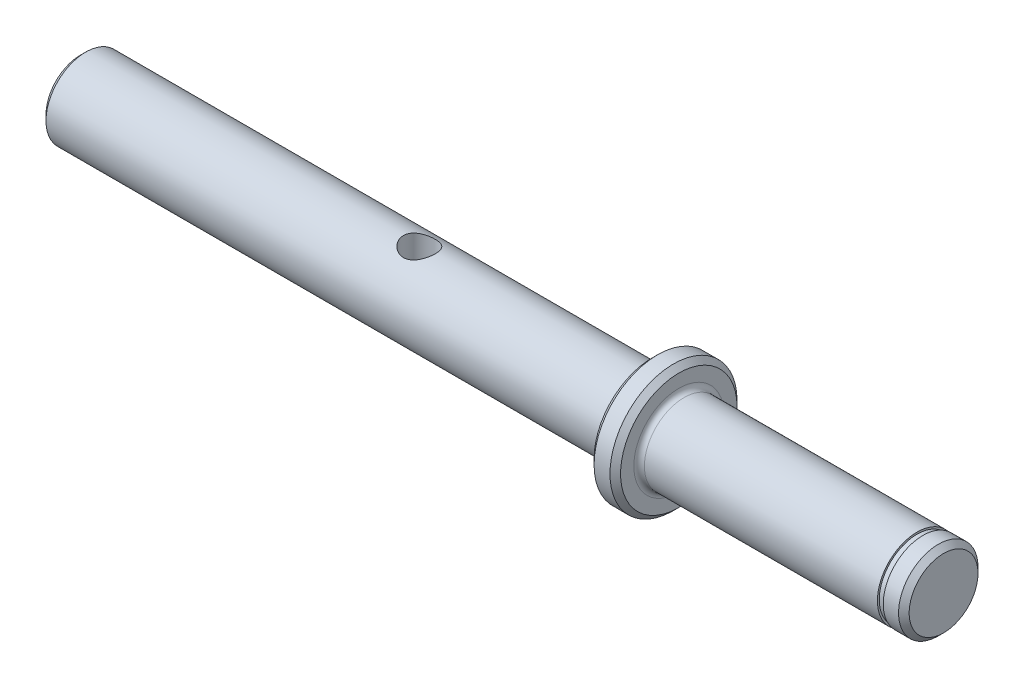
ISO-10303-21;
HEADER;
FILE_DESCRIPTION(('STEP AP214'),'2;1');
FILE_NAME('part.step','',(''),(''),'','','');
FILE_SCHEMA(('AUTOMOTIVE_DESIGN { 1 0 10303 214 1 1 1 1 }'));
ENDSEC;
DATA;
#1=APPLICATION_CONTEXT('core data for automotive mechanical design processes');
#2=APPLICATION_PROTOCOL_DEFINITION('international standard','automotive_design',2000,#1);
#3=PRODUCT_CONTEXT('',#1,'mechanical');
#4=PRODUCT('Part','Part','',(#3));
#5=PRODUCT_RELATED_PRODUCT_CATEGORY('part','',(#4));
#6=PRODUCT_DEFINITION_FORMATION('','',#4);
#7=PRODUCT_DEFINITION_CONTEXT('part definition',#1,'design');
#8=PRODUCT_DEFINITION('design','',#6,#7);
#9=PRODUCT_DEFINITION_SHAPE('','',#8);
#10=(LENGTH_UNIT() NAMED_UNIT(*) SI_UNIT(.MILLI.,.METRE.));
#11=(NAMED_UNIT(*) PLANE_ANGLE_UNIT() SI_UNIT($,.RADIAN.));
#12=(NAMED_UNIT(*) SI_UNIT($,.STERADIAN.) SOLID_ANGLE_UNIT());
#13=UNCERTAINTY_MEASURE_WITH_UNIT(LENGTH_MEASURE(1.E-05),#10,'distance_accuracy_value','');
#14=(GEOMETRIC_REPRESENTATION_CONTEXT(3) GLOBAL_UNCERTAINTY_ASSIGNED_CONTEXT((#13)) GLOBAL_UNIT_ASSIGNED_CONTEXT((#10,
#11,#12)) REPRESENTATION_CONTEXT('',''));
#15=CARTESIAN_POINT('',(0.,0.,0.));
#16=DIRECTION('',(0.,0.,1.));
#17=DIRECTION('',(1.,0.,0.));
#18=AXIS2_PLACEMENT_3D('',#15,#16,#17);
#19=CARTESIAN_POINT('',(0.,0.,0.));
#20=DIRECTION('',(1.,0.,0.));
#21=DIRECTION('',(0.,0.,-1.));
#22=AXIS2_PLACEMENT_3D('',#19,#20,#21);
#23=CYLINDRICAL_SURFACE('',#22,7.5);
#24=CARTESIAN_POINT('',(106.,0.,0.));
#25=DIRECTION('',(-1.,0.,0.));
#26=DIRECTION('',(0.,0.,1.));
#27=AXIS2_PLACEMENT_3D('',#24,#25,#26);
#28=CIRCLE('',#27,7.5);
#29=CARTESIAN_POINT('',(106.,0.,7.5));
#30=VERTEX_POINT('',#29);
#31=EDGE_CURVE('E52',#30,#30,#28,.T.);
#32=ORIENTED_EDGE('',*,*,#31,.T.);
#33=EDGE_LOOP('',(#32));
#34=FACE_BOUND('',#33,.T.);
#35=CARTESIAN_POINT('',(0.999999999999997,0.,0.));
#36=DIRECTION('',(-1.,0.,0.));
#37=DIRECTION('',(0.,0.,1.));
#38=AXIS2_PLACEMENT_3D('',#35,#36,#37);
#39=CIRCLE('',#38,7.5);
#40=CARTESIAN_POINT('',(0.999999999999997,0.,7.5));
#41=VERTEX_POINT('',#40);
#42=EDGE_CURVE('E67',#41,#41,#39,.F.);
#43=ORIENTED_EDGE('',*,*,#42,.T.);
#44=EDGE_LOOP('',(#43));
#45=FACE_BOUND('',#44,.T.);
#46=CARTESIAN_POINT('',(64.,-6.87386354243376,-3.00000000000001));
#47=CARTESIAN_POINT('',(63.8393144654306,-6.87387034169605,-2.99999310102034));
#48=CARTESIAN_POINT('',(63.6783605585022,-6.87957650695683,-2.98701260330111));
#49=CARTESIAN_POINT('',(63.3610913738506,-6.901666249599,-2.93560066312236));
#50=CARTESIAN_POINT('',(63.2047890184922,-6.9180771094252,-2.89710418548512));
#51=CARTESIAN_POINT('',(62.9019222865438,-6.95940616078833,-2.79635331714324));
#52=CARTESIAN_POINT('',(62.7553236350632,-6.98429226391323,-2.73418843497827));
#53=CARTESIAN_POINT('',(62.4746719677065,-7.0397201578331,-2.58813019791229));
#54=CARTESIAN_POINT('',(62.3406162212138,-7.07026071330917,-2.5042415873656));
#55=CARTESIAN_POINT('',(62.0811095281835,-7.13551292343503,-2.31198302134881));
#56=CARTESIAN_POINT('',(61.9564654009041,-7.17035875533909,-2.20256905254826));
#57=CARTESIAN_POINT('',(61.7267064687163,-7.23918686872916,-1.96456364269823));
#58=CARTESIAN_POINT('',(61.6215984884354,-7.27316884487642,-1.8359655281602));
#59=CARTESIAN_POINT('',(61.4298904145354,-7.33805111462092,-1.55700947005954));
#60=CARTESIAN_POINT('',(61.3441835504711,-7.36877705418855,-1.40599344962864));
#61=CARTESIAN_POINT('',(61.1997346447393,-7.42205891553774,-1.09023798310295));
#62=CARTESIAN_POINT('',(61.1409816306267,-7.44461816104874,-0.925504153615321));
#63=CARTESIAN_POINT('',(61.0549877710104,-7.47807487485913,-0.595449640559626));
#64=CARTESIAN_POINT('',(61.0263590290447,-7.48948405155942,-0.43054347728747));
#65=CARTESIAN_POINT('',(60.9969572713278,-7.50120466031146,-0.0978994928759376));
#66=CARTESIAN_POINT('',(60.9961738660513,-7.50152023155835,0.0698372487591226));
#67=CARTESIAN_POINT('',(61.0217241547063,-7.49132944230919,0.39334874205314));
#68=CARTESIAN_POINT('',(61.0465371591321,-7.48142995157228,0.549266179305693));
#69=CARTESIAN_POINT('',(61.1199893144545,-7.45273937203712,0.854509663832879));
#70=CARTESIAN_POINT('',(61.1686302135977,-7.43394763082012,1.00383522658687));
#71=CARTESIAN_POINT('',(61.2889547243174,-7.388952366862,1.29434690776585));
#72=CARTESIAN_POINT('',(61.3609745722231,-7.36264140699335,1.43537643506835));
#73=CARTESIAN_POINT('',(61.5256975103787,-7.30521877770412,1.70371222611198));
#74=CARTESIAN_POINT('',(61.6184076896502,-7.27410546400724,1.83101376407695));
#75=CARTESIAN_POINT('',(61.8289737039158,-7.20782455764184,2.07715324198527));
#76=CARTESIAN_POINT('',(61.9480808388592,-7.17252489767638,2.19488676789949));
#77=CARTESIAN_POINT('',(62.204485857748,-7.10342491459894,2.40916112308898));
#78=CARTESIAN_POINT('',(62.3417896722934,-7.06962508512114,2.50569501568048));
#79=CARTESIAN_POINT('',(62.6356285335609,-7.00645346113534,2.67735628307892));
#80=CARTESIAN_POINT('',(62.792597245508,-6.97723371086561,2.7518019774544));
#81=CARTESIAN_POINT('',(63.1183232354683,-6.92831385516126,2.8727643897997));
#82=CARTESIAN_POINT('',(63.2870727770899,-6.90860756836966,2.91929924756698));
#83=CARTESIAN_POINT('',(63.6205536662012,-6.88244639554074,2.98043242328235));
#84=CARTESIAN_POINT('',(63.7849006706928,-6.87525549684207,2.99680814522182));
#85=CARTESIAN_POINT('',(64.1141158116393,-6.87284246803558,3.00234198966434));
#86=CARTESIAN_POINT('',(64.2789837749135,-6.87761670840543,2.99150836588693));
#87=CARTESIAN_POINT('',(64.5946884024354,-6.8978406653867,2.94454934218505));
#88=CARTESIAN_POINT('',(64.7457894061001,-6.91266686697452,2.9098995930358));
#89=CARTESIAN_POINT('',(65.0399326071782,-6.9505507654101,2.81820628036631));
#90=CARTESIAN_POINT('',(65.1829730096607,-6.97361028732897,2.76115775145342));
#91=CARTESIAN_POINT('',(65.4634035366935,-7.02650672790152,2.62370345922236));
#92=CARTESIAN_POINT('',(65.6003292830418,-7.05658056958766,2.54244430239697));
#93=CARTESIAN_POINT('',(65.8592244811624,-7.11975577736693,2.35974783666273));
#94=CARTESIAN_POINT('',(65.9811878091932,-7.15285837344067,2.25830231022284));
#95=CARTESIAN_POINT('',(66.2160601128991,-7.22131373957125,2.02926631752086));
#96=CARTESIAN_POINT('',(66.3276348479374,-7.2566521092785,1.90029814416815));
#97=CARTESIAN_POINT('',(66.5277656149147,-7.32329691851298,1.62462545005275));
#98=CARTESIAN_POINT('',(66.6163207098927,-7.35460319389703,1.47792020769991));
#99=CARTESIAN_POINT('',(66.767571439695,-7.40975573850585,1.17041990100452));
#100=CARTESIAN_POINT('',(66.8302732662605,-7.4336037936099,1.00962822149812));
#101=CARTESIAN_POINT('',(66.9273232785996,-7.47109070203356,0.678590386371822));
#102=CARTESIAN_POINT('',(66.961686852116,-7.48473509559155,0.508349415415228));
#103=CARTESIAN_POINT('',(66.9992570524793,-7.49968512317788,0.17522476554392));
#104=CARTESIAN_POINT('',(67.004350192843,-7.50173770124618,0.0125857389781277));
#105=CARTESIAN_POINT('',(66.9882167809248,-7.49529063560582,-0.311150753688403));
#106=CARTESIAN_POINT('',(66.9669942127666,-7.48679258923162,-0.472248449421586));
#107=CARTESIAN_POINT('',(66.9001798180002,-7.46057270072754,-0.783256352600104));
#108=CARTESIAN_POINT('',(66.8553565828652,-7.44314221048496,-0.933358205797312));
#109=CARTESIAN_POINT('',(66.7434207911784,-7.40092421651037,-1.22388353331391));
#110=CARTESIAN_POINT('',(66.6763041235914,-7.37613535594289,-1.36430521678369));
#111=CARTESIAN_POINT('',(66.5183452099702,-7.320271419178,-1.63830455820774));
#112=CARTESIAN_POINT('',(66.4265855870123,-7.288966960308,-1.77130556278109));
#113=CARTESIAN_POINT('',(66.2233171918795,-7.22384103340619,-2.02058106022191));
#114=CARTESIAN_POINT('',(66.1118002455877,-7.19001852696379,-2.13684859379604));
#115=CARTESIAN_POINT('',(65.864027279727,-7.1210665105152,-2.35680182841674));
#116=CARTESIAN_POINT('',(65.7266671372839,-7.08598570842144,-2.45926306504163));
#117=CARTESIAN_POINT('',(65.4355863464188,-7.02074485276124,-2.63977144144724));
#118=CARTESIAN_POINT('',(65.2818637773197,-6.99058537793172,-2.71781571083652));
#119=CARTESIAN_POINT('',(64.9764457202947,-6.94138371358595,-2.84098572677452));
#120=CARTESIAN_POINT('',(64.8258075959314,-6.92158645020622,-2.88843803497902));
#121=CARTESIAN_POINT('',(64.518266437761,-6.89168739051179,-2.95907986392735));
#122=CARTESIAN_POINT('',(64.3613821398635,-6.88155858435652,-2.98233699287412));
#123=CARTESIAN_POINT('',(64.1698326413327,-6.87587645913135,-2.9953830327827));
#124=CARTESIAN_POINT('',(64.1358977794654,-6.87512296675926,-2.99711296127843));
#125=CARTESIAN_POINT('',(64.0679792848042,-6.87411577084084,-2.99942221686376));
#126=CARTESIAN_POINT('',(64.0339956486173,-6.8738621039388,-3.00000145959181));
#127=CARTESIAN_POINT('',(64.,-6.87386354243376,-3.00000000000001));
#128=B_SPLINE_CURVE_WITH_KNOTS('',3,(#46,#47,#48,#49,#50,#51,#52,#53,#54,#55,#56,#57,#58,#59,
#60,#61,#62,#63,#64,#65,#66,#67,#68,#69,#70,#71,#72,#73,#74,#75,#76,#77,#78,#79,#80,#81,#82,#83,
#84,#85,#86,#87,#88,#89,#90,#91,#92,#93,#94,#95,#96,#97,#98,#99,#100,#101,#102,#103,#104,#105,
#106,#107,#108,#109,#110,#111,#112,#113,#114,#115,#116,#117,#118,#119,#120,#121,#122,#123,#124,
#125,#126,#127),.UNSPECIFIED.,.T.,.F.,(4,2,2,2,2,2,2,2,2,2,2,2,2,2,2,2,2,2,2,2,2,2,2,2,2,2,2,2,
2,2,2,2,2,2,2,2,2,2,2,2,4),(0.,0.481916473151485,0.965066003733377,1.44640623494009,
1.92764143235794,2.43383427426639,2.94020361522515,3.46654003637144,3.99266200454222,
4.49331274330777,4.9937766795851,5.46612967245455,5.93851732693591,6.41802450352349,
6.89769622410049,7.40886066122036,7.92019210690693,8.44596688075889,8.97139957200156,
9.46473221286632,9.95791522361912,10.4230087212772,10.8882053797746,11.3722673197906,
11.8565267178878,12.3765560137047,12.8966064727912,13.4165323096922,13.9361756393121,
14.4219155963393,14.9075820226891,15.3783299166503,15.8491646674288,16.3408057670989,
16.8326507484631,17.3549437992842,17.8772982263879,18.3527499122862,18.8268694532887,
18.928819278144,19.0307765770884),.UNSPECIFIED.);
#129=CARTESIAN_POINT('',(64.,-6.87386354243376,-3.00000000000001));
#130=VERTEX_POINT('',#129);
#131=EDGE_CURVE('E106',#130,#130,#128,.T.);
#132=ORIENTED_EDGE('',*,*,#131,.T.);
#133=EDGE_LOOP('',(#132));
#134=FACE_BOUND('',#133,.T.);
#135=CARTESIAN_POINT('',(64.,6.87386354243376,-3.00000000000001));
#136=CARTESIAN_POINT('',(64.1606855345694,6.87387034169604,-2.99999310102034));
#137=CARTESIAN_POINT('',(64.3216394414978,6.87957650695683,-2.98701260330111));
#138=CARTESIAN_POINT('',(64.6389086261494,6.901666249599,-2.93560066312236));
#139=CARTESIAN_POINT('',(64.7952109815078,6.9180771094252,-2.89710418548511));
#140=CARTESIAN_POINT('',(65.0980777134562,6.95940616078833,-2.79635331714324));
#141=CARTESIAN_POINT('',(65.2446763649369,6.98429226391323,-2.73418843497827));
#142=CARTESIAN_POINT('',(65.5253280322935,7.0397201578331,-2.58813019791229));
#143=CARTESIAN_POINT('',(65.6593837787862,7.07026071330917,-2.5042415873656));
#144=CARTESIAN_POINT('',(65.9188904718165,7.13551292343503,-2.31198302134881));
#145=CARTESIAN_POINT('',(66.0435345990959,7.17035875533909,-2.20256905254827));
#146=CARTESIAN_POINT('',(66.2732935312837,7.23918686872916,-1.96456364269823));
#147=CARTESIAN_POINT('',(66.3784015115646,7.27316884487642,-1.83596552816021));
#148=CARTESIAN_POINT('',(66.5701095854646,7.33805111462092,-1.55700947005955));
#149=CARTESIAN_POINT('',(66.6558164495289,7.36877705418855,-1.40599344962864));
#150=CARTESIAN_POINT('',(66.8002653552607,7.42205891553774,-1.09023798310295));
#151=CARTESIAN_POINT('',(66.8590183693733,7.44461816104874,-0.92550415361532));
#152=CARTESIAN_POINT('',(66.9450122289896,7.47807487485913,-0.595449640559623));
#153=CARTESIAN_POINT('',(66.9736409709553,7.48948405155942,-0.430543477287467));
#154=CARTESIAN_POINT('',(67.0030427286722,7.50120466031146,-0.097899492875934));
#155=CARTESIAN_POINT('',(67.0038261339487,7.50152023155834,0.0698372487591263));
#156=CARTESIAN_POINT('',(66.9782758452937,7.49132944230918,0.393348742053143));
#157=CARTESIAN_POINT('',(66.9534628408679,7.48142995157228,0.549266179305695));
#158=CARTESIAN_POINT('',(66.8800106855456,7.45273937203712,0.85450966383288));
#159=CARTESIAN_POINT('',(66.8313697864023,7.43394763082012,1.00383522658687));
#160=CARTESIAN_POINT('',(66.7110452756826,7.388952366862,1.29434690776585));
#161=CARTESIAN_POINT('',(66.6390254277769,7.36264140699335,1.43537643506835));
#162=CARTESIAN_POINT('',(66.4743024896213,7.30521877770412,1.70371222611198));
#163=CARTESIAN_POINT('',(66.3815923103498,7.27410546400724,1.83101376407695));
#164=CARTESIAN_POINT('',(66.1710262960842,7.20782455764184,2.07715324198527));
#165=CARTESIAN_POINT('',(66.0519191611408,7.17252489767638,2.19488676789949));
#166=CARTESIAN_POINT('',(65.795514142252,7.10342491459894,2.40916112308899));
#167=CARTESIAN_POINT('',(65.6582103277066,7.06962508512114,2.50569501568049));
#168=CARTESIAN_POINT('',(65.3643714664391,7.00645346113534,2.67735628307892));
#169=CARTESIAN_POINT('',(65.207402754492,6.97723371086561,2.7518019774544));
#170=CARTESIAN_POINT('',(64.8816767645317,6.92831385516126,2.8727643897997));
#171=CARTESIAN_POINT('',(64.7129272229101,6.90860756836966,2.91929924756698));
#172=CARTESIAN_POINT('',(64.3794463337988,6.88244639554074,2.98043242328235));
#173=CARTESIAN_POINT('',(64.2150993293072,6.87525549684207,2.99680814522182));
#174=CARTESIAN_POINT('',(63.8858841883606,6.87284246803558,3.00234198966434));
#175=CARTESIAN_POINT('',(63.7210162250865,6.87761670840543,2.99150836588693));
#176=CARTESIAN_POINT('',(63.4053115975646,6.8978406653867,2.94454934218505));
#177=CARTESIAN_POINT('',(63.2542105938999,6.91266686697452,2.90989959303579));
#178=CARTESIAN_POINT('',(62.9600673928218,6.9505507654101,2.81820628036631));
#179=CARTESIAN_POINT('',(62.8170269903393,6.97361028732897,2.76115775145342));
#180=CARTESIAN_POINT('',(62.5365964633065,7.02650672790152,2.62370345922236));
#181=CARTESIAN_POINT('',(62.3996707169582,7.05658056958766,2.54244430239697));
#182=CARTESIAN_POINT('',(62.1407755188376,7.11975577736693,2.35974783666273));
#183=CARTESIAN_POINT('',(62.0188121908068,7.15285837344067,2.25830231022284));
#184=CARTESIAN_POINT('',(61.7839398871009,7.22131373957125,2.02926631752087));
#185=CARTESIAN_POINT('',(61.6723651520626,7.2566521092785,1.90029814416815));
#186=CARTESIAN_POINT('',(61.4722343850853,7.32329691851298,1.62462545005276));
#187=CARTESIAN_POINT('',(61.3836792901073,7.35460319389703,1.47792020769991));
#188=CARTESIAN_POINT('',(61.232428560305,7.40975573850585,1.17041990100452));
#189=CARTESIAN_POINT('',(61.1697267337395,7.4336037936099,1.00962822149811));
#190=CARTESIAN_POINT('',(61.0726767214004,7.47109070203356,0.678590386371816));
#191=CARTESIAN_POINT('',(61.038313147884,7.48473509559155,0.508349415415223));
#192=CARTESIAN_POINT('',(61.0007429475207,7.49968512317788,0.175224765543915));
#193=CARTESIAN_POINT('',(60.995649807157,7.50173770124618,0.0125857389781229));
#194=CARTESIAN_POINT('',(61.0117832190752,7.49529063560582,-0.311150753688407));
#195=CARTESIAN_POINT('',(61.0330057872334,7.48679258923162,-0.472248449421589));
#196=CARTESIAN_POINT('',(61.0998201819998,7.46057270072754,-0.783256352600106));
#197=CARTESIAN_POINT('',(61.1446434171348,7.44314221048496,-0.933358205797313));
#198=CARTESIAN_POINT('',(61.2565792088216,7.40092421651037,-1.22388353331392));
#199=CARTESIAN_POINT('',(61.3236958764086,7.37613535594289,-1.36430521678369));
#200=CARTESIAN_POINT('',(61.4816547900299,7.320271419178,-1.63830455820774));
#201=CARTESIAN_POINT('',(61.5734144129877,7.288966960308,-1.77130556278109));
#202=CARTESIAN_POINT('',(61.7766828081205,7.22384103340619,-2.02058106022191));
#203=CARTESIAN_POINT('',(61.8881997544123,7.19001852696379,-2.13684859379603));
#204=CARTESIAN_POINT('',(62.135972720273,7.1210665105152,-2.35680182841675));
#205=CARTESIAN_POINT('',(62.2733328627162,7.08598570842144,-2.45926306504163));
#206=CARTESIAN_POINT('',(62.5644136535812,7.02074485276124,-2.63977144144725));
#207=CARTESIAN_POINT('',(62.7181362226803,6.99058537793172,-2.71781571083652));
#208=CARTESIAN_POINT('',(63.0235542797053,6.94138371358595,-2.84098572677452));
#209=CARTESIAN_POINT('',(63.1741924040686,6.92158645020622,-2.88843803497901));
#210=CARTESIAN_POINT('',(63.4817335622389,6.89168739051179,-2.95907986392734));
#211=CARTESIAN_POINT('',(63.6386178601365,6.88155858435652,-2.98233699287412));
#212=CARTESIAN_POINT('',(63.8301673586673,6.87587645913135,-2.9953830327827));
#213=CARTESIAN_POINT('',(63.8641022205347,6.87512296675926,-2.99711296127843));
#214=CARTESIAN_POINT('',(63.9320207151958,6.87411577084084,-2.99942221686376));
#215=CARTESIAN_POINT('',(63.9660043513827,6.8738621039388,-3.00000145959181));
#216=CARTESIAN_POINT('',(64.,6.87386354243376,-3.00000000000001));
#217=B_SPLINE_CURVE_WITH_KNOTS('',3,(#135,#136,#137,#138,#139,#140,#141,#142,#143,#144,#145,
#146,#147,#148,#149,#150,#151,#152,#153,#154,#155,#156,#157,#158,#159,#160,#161,#162,#163,#164,
#165,#166,#167,#168,#169,#170,#171,#172,#173,#174,#175,#176,#177,#178,#179,#180,#181,#182,#183,
#184,#185,#186,#187,#188,#189,#190,#191,#192,#193,#194,#195,#196,#197,#198,#199,#200,#201,#202,
#203,#204,#205,#206,#207,#208,#209,#210,#211,#212,#213,#214,#215,#216),.UNSPECIFIED.,.T.,.F.,(4,
2,2,2,2,2,2,2,2,2,2,2,2,2,2,2,2,2,2,2,2,2,2,2,2,2,2,2,2,2,2,2,2,2,2,2,2,2,2,2,4),(0.,
0.481916473151485,0.965066003733377,1.44640623494009,1.92764143235792,2.43383427426639,
2.94020361522514,3.46654003637144,3.99266200454223,4.49331274330777,4.9937766795851,
5.46612967245456,5.93851732693592,6.41802450352349,6.89769622410049,7.40886066122036,
7.92019210690694,8.4459668807589,8.97139957200156,9.46473221286634,9.95791522361914,
10.4230087212772,10.8882053797746,11.3722673197906,11.8565267178878,12.3765560137047,
12.8966064727913,13.4165323096922,13.9361756393121,14.4219155963393,14.9075820226891,
15.3783299166503,15.8491646674288,16.3408057670989,16.8326507484631,17.3549437992842,
17.8772982263879,18.3527499122862,18.8268694532887,18.928819278144,19.0307765770884),.UNSPECIFIED.);
#218=CARTESIAN_POINT('',(64.,6.87386354243376,-3.00000000000001));
#219=VERTEX_POINT('',#218);
#220=EDGE_CURVE('E96',#219,#219,#217,.T.);
#221=ORIENTED_EDGE('',*,*,#220,.T.);
#222=EDGE_LOOP('',(#221));
#223=FACE_BOUND('',#222,.T.);
#224=ADVANCED_FACE('F39',(#34,#45,#134,#223),#23,.T.);
#225=CARTESIAN_POINT('',(0.,0.,0.));
#226=DIRECTION('',(-1.,0.,0.));
#227=DIRECTION('',(0.,0.,1.));
#228=AXIS2_PLACEMENT_3D('',#225,#226,#227);
#229=PLANE('',#228);
#230=CARTESIAN_POINT('',(0.,0.,0.));
#231=DIRECTION('',(-1.,0.,0.));
#232=DIRECTION('',(0.,0.,1.));
#233=AXIS2_PLACEMENT_3D('',#230,#231,#232);
#234=CIRCLE('',#233,6.50000000000001);
#235=CARTESIAN_POINT('',(0.,0.,6.50000000000001));
#236=VERTEX_POINT('',#235);
#237=EDGE_CURVE('E63',#236,#236,#234,.T.);
#238=ORIENTED_EDGE('',*,*,#237,.T.);
#239=EDGE_LOOP('',(#238));
#240=FACE_BOUND('',#239,.T.);
#241=ADVANCED_FACE('F152',(#240),#229,.T.);
#242=CARTESIAN_POINT('',(108.,7.5,0.));
#243=DIRECTION('',(-1.,0.,0.));
#244=DIRECTION('',(0.,0.,1.));
#245=AXIS2_PLACEMENT_3D('',#242,#243,#244);
#246=PLANE('',#245);
#247=CARTESIAN_POINT('',(108.,0.,0.));
#248=DIRECTION('',(-1.,0.,0.));
#249=DIRECTION('',(0.,0.,1.));
#250=AXIS2_PLACEMENT_3D('',#247,#248,#249);
#251=CIRCLE('',#250,9.5);
#252=CARTESIAN_POINT('',(108.,0.,9.5));
#253=VERTEX_POINT('',#252);
#254=EDGE_CURVE('E57',#253,#253,#251,.F.);
#255=ORIENTED_EDGE('',*,*,#254,.T.);
#256=EDGE_LOOP('',(#255));
#257=FACE_BOUND('',#256,.T.);
#258=CARTESIAN_POINT('',(108.,0.,0.));
#259=DIRECTION('',(-1.,0.,0.));
#260=DIRECTION('',(0.,0.,1.));
#261=AXIS2_PLACEMENT_3D('',#258,#259,#260);
#262=CIRCLE('',#261,11.);
#263=CARTESIAN_POINT('',(108.,0.,11.));
#264=VERTEX_POINT('',#263);
#265=EDGE_CURVE('E71',#264,#264,#262,.T.);
#266=ORIENTED_EDGE('',*,*,#265,.T.);
#267=EDGE_LOOP('',(#266));
#268=FACE_BOUND('',#267,.T.);
#269=ADVANCED_FACE('F149',(#257,#268),#246,.T.);
#270=CARTESIAN_POINT('',(0.,0.,0.));
#271=DIRECTION('',(1.,0.,0.));
#272=DIRECTION('',(0.,0.,-1.));
#273=AXIS2_PLACEMENT_3D('',#270,#271,#272);
#274=CYLINDRICAL_SURFACE('',#273,12.);
#275=CARTESIAN_POINT('',(112.,0.,0.));
#276=DIRECTION('',(1.,0.,0.));
#277=DIRECTION('',(0.,0.,-1.));
#278=AXIS2_PLACEMENT_3D('',#275,#276,#277);
#279=CIRCLE('',#278,12.);
#280=CARTESIAN_POINT('',(112.,0.,-12.));
#281=VERTEX_POINT('',#280);
#282=EDGE_CURVE('E75',#281,#281,#279,.F.);
#283=ORIENTED_EDGE('',*,*,#282,.T.);
#284=EDGE_LOOP('',(#283));
#285=FACE_BOUND('',#284,.T.);
#286=CARTESIAN_POINT('',(109.,0.,0.));
#287=DIRECTION('',(-1.,0.,0.));
#288=DIRECTION('',(0.,0.,1.));
#289=AXIS2_PLACEMENT_3D('',#286,#287,#288);
#290=CIRCLE('',#289,12.);
#291=CARTESIAN_POINT('',(109.,0.,12.));
#292=VERTEX_POINT('',#291);
#293=EDGE_CURVE('E79',#292,#292,#290,.F.);
#294=ORIENTED_EDGE('',*,*,#293,.T.);
#295=EDGE_LOOP('',(#294));
#296=FACE_BOUND('',#295,.T.);
#297=ADVANCED_FACE('F147',(#285,#296),#274,.T.);
#298=CARTESIAN_POINT('',(113.,7.5,0.));
#299=DIRECTION('',(1.,0.,0.));
#300=DIRECTION('',(0.,0.,-1.));
#301=AXIS2_PLACEMENT_3D('',#298,#299,#300);
#302=PLANE('',#301);
#303=CARTESIAN_POINT('',(113.,0.,0.));
#304=DIRECTION('',(1.,0.,0.));
#305=DIRECTION('',(0.,0.,-1.));
#306=AXIS2_PLACEMENT_3D('',#303,#304,#305);
#307=CIRCLE('',#306,8.5);
#308=CARTESIAN_POINT('',(113.,0.,-8.5));
#309=VERTEX_POINT('',#308);
#310=EDGE_CURVE('E10',#309,#309,#307,.F.);
#311=ORIENTED_EDGE('',*,*,#310,.T.);
#312=EDGE_LOOP('',(#311));
#313=FACE_BOUND('',#312,.T.);
#314=CARTESIAN_POINT('',(113.,0.,0.));
#315=DIRECTION('',(1.,0.,0.));
#316=DIRECTION('',(0.,0.,-1.));
#317=AXIS2_PLACEMENT_3D('',#314,#315,#316);
#318=CIRCLE('',#317,11.);
#319=CARTESIAN_POINT('',(113.,0.,-11.));
#320=VERTEX_POINT('',#319);
#321=EDGE_CURVE('E83',#320,#320,#318,.T.);
#322=ORIENTED_EDGE('',*,*,#321,.T.);
#323=EDGE_LOOP('',(#322));
#324=FACE_BOUND('',#323,.T.);
#325=ADVANCED_FACE('F144',(#313,#324),#302,.T.);
#326=CARTESIAN_POINT('',(0.,0.,0.));
#327=DIRECTION('',(1.,0.,0.));
#328=DIRECTION('',(0.,0.,-1.));
#329=AXIS2_PLACEMENT_3D('',#326,#327,#328);
#330=CYLINDRICAL_SURFACE('',#329,7.5);
#331=CARTESIAN_POINT('',(114.,0.,0.));
#332=DIRECTION('',(1.,0.,0.));
#333=DIRECTION('',(0.,0.,-1.));
#334=AXIS2_PLACEMENT_3D('',#331,#332,#333);
#335=CIRCLE('',#334,7.5);
#336=CARTESIAN_POINT('',(114.,0.,-7.5));
#337=VERTEX_POINT('',#336);
#338=EDGE_CURVE('E47',#337,#337,#335,.T.);
#339=ORIENTED_EDGE('',*,*,#338,.T.);
#340=EDGE_LOOP('',(#339));
#341=FACE_BOUND('',#340,.T.);
#342=CARTESIAN_POINT('',(158.,0.,0.));
#343=DIRECTION('',(1.,0.,0.));
#344=DIRECTION('',(0.,0.,-1.));
#345=AXIS2_PLACEMENT_3D('',#342,#343,#344);
#346=CIRCLE('',#345,7.5);
#347=CARTESIAN_POINT('',(158.,0.,-7.5));
#348=VERTEX_POINT('',#347);
#349=EDGE_CURVE('E95',#348,#348,#346,.T.);
#350=ORIENTED_EDGE('',*,*,#349,.F.);
#351=EDGE_LOOP('',(#350));
#352=FACE_BOUND('',#351,.T.);
#353=ADVANCED_FACE('F140',(#341,#352),#330,.T.);
#354=CARTESIAN_POINT('',(158.,7.5,0.));
#355=DIRECTION('',(1.,0.,0.));
#356=DIRECTION('',(0.,0.,-1.));
#357=AXIS2_PLACEMENT_3D('',#354,#355,#356);
#358=PLANE('',#357);
#359=ORIENTED_EDGE('',*,*,#349,.T.);
#360=EDGE_LOOP('',(#359));
#361=FACE_BOUND('',#360,.T.);
#362=CARTESIAN_POINT('',(158.,0.,0.));
#363=DIRECTION('',(1.,0.,0.));
#364=DIRECTION('',(0.,0.,-1.));
#365=AXIS2_PLACEMENT_3D('',#362,#363,#364);
#366=CIRCLE('',#365,7.15);
#367=CARTESIAN_POINT('',(158.,0.,-7.15));
#368=VERTEX_POINT('',#367);
#369=EDGE_CURVE('E180',#368,#368,#366,.T.);
#370=ORIENTED_EDGE('',*,*,#369,.F.);
#371=EDGE_LOOP('',(#370));
#372=FACE_BOUND('',#371,.T.);
#373=ADVANCED_FACE('F136',(#361,#372),#358,.T.);
#374=CARTESIAN_POINT('',(0.,0.,0.));
#375=DIRECTION('',(1.,0.,0.));
#376=DIRECTION('',(0.,0.,-1.));
#377=AXIS2_PLACEMENT_3D('',#374,#375,#376);
#378=CYLINDRICAL_SURFACE('',#377,7.15);
#379=ORIENTED_EDGE('',*,*,#369,.T.);
#380=EDGE_LOOP('',(#379));
#381=FACE_BOUND('',#380,.T.);
#382=CARTESIAN_POINT('',(159.1,0.,0.));
#383=DIRECTION('',(1.,0.,0.));
#384=DIRECTION('',(0.,0.,-1.));
#385=AXIS2_PLACEMENT_3D('',#382,#383,#384);
#386=CIRCLE('',#385,7.15);
#387=CARTESIAN_POINT('',(159.1,0.,-7.15));
#388=VERTEX_POINT('',#387);
#389=EDGE_CURVE('E176',#388,#388,#386,.T.);
#390=ORIENTED_EDGE('',*,*,#389,.F.);
#391=EDGE_LOOP('',(#390));
#392=FACE_BOUND('',#391,.T.);
#393=ADVANCED_FACE('F132',(#381,#392),#378,.T.);
#394=CARTESIAN_POINT('',(159.1,7.5,0.));
#395=DIRECTION('',(-1.,0.,0.));
#396=DIRECTION('',(0.,0.,1.));
#397=AXIS2_PLACEMENT_3D('',#394,#395,#396);
#398=PLANE('',#397);
#399=ORIENTED_EDGE('',*,*,#389,.T.);
#400=EDGE_LOOP('',(#399));
#401=FACE_BOUND('',#400,.T.);
#402=CARTESIAN_POINT('',(159.1,0.,0.));
#403=DIRECTION('',(1.,0.,0.));
#404=DIRECTION('',(0.,0.,-1.));
#405=AXIS2_PLACEMENT_3D('',#402,#403,#404);
#406=CIRCLE('',#405,7.5);
#407=CARTESIAN_POINT('',(159.1,0.,-7.5));
#408=VERTEX_POINT('',#407);
#409=EDGE_CURVE('E105',#408,#408,#406,.T.);
#410=ORIENTED_EDGE('',*,*,#409,.F.);
#411=EDGE_LOOP('',(#410));
#412=FACE_BOUND('',#411,.T.);
#413=ADVANCED_FACE('F128',(#401,#412),#398,.T.);
#414=CARTESIAN_POINT('',(0.,0.,0.));
#415=DIRECTION('',(1.,0.,0.));
#416=DIRECTION('',(0.,0.,-1.));
#417=AXIS2_PLACEMENT_3D('',#414,#415,#416);
#418=CYLINDRICAL_SURFACE('',#417,7.5);
#419=CARTESIAN_POINT('',(162.,0.,0.));
#420=DIRECTION('',(1.,0.,0.));
#421=DIRECTION('',(0.,0.,-1.));
#422=AXIS2_PLACEMENT_3D('',#419,#420,#421);
#423=CIRCLE('',#422,7.5);
#424=CARTESIAN_POINT('',(162.,0.,-7.5));
#425=VERTEX_POINT('',#424);
#426=EDGE_CURVE('E87',#425,#425,#423,.F.);
#427=ORIENTED_EDGE('',*,*,#426,.T.);
#428=EDGE_LOOP('',(#427));
#429=FACE_BOUND('',#428,.T.);
#430=ORIENTED_EDGE('',*,*,#409,.T.);
#431=EDGE_LOOP('',(#430));
#432=FACE_BOUND('',#431,.T.);
#433=ADVANCED_FACE('F124',(#429,#432),#418,.T.);
#434=CARTESIAN_POINT('',(163.,7.5,0.));
#435=DIRECTION('',(1.,0.,0.));
#436=DIRECTION('',(0.,0.,-1.));
#437=AXIS2_PLACEMENT_3D('',#434,#435,#436);
#438=PLANE('',#437);
#439=CARTESIAN_POINT('',(163.,0.,0.));
#440=DIRECTION('',(1.,0.,0.));
#441=DIRECTION('',(0.,0.,-1.));
#442=AXIS2_PLACEMENT_3D('',#439,#440,#441);
#443=CIRCLE('',#442,6.50000000000001);
#444=CARTESIAN_POINT('',(163.,0.,-6.50000000000001));
#445=VERTEX_POINT('',#444);
#446=EDGE_CURVE('E91',#445,#445,#443,.T.);
#447=ORIENTED_EDGE('',*,*,#446,.T.);
#448=EDGE_LOOP('',(#447));
#449=FACE_BOUND('',#448,.T.);
#450=ADVANCED_FACE('F119',(#449),#438,.T.);
#451=CARTESIAN_POINT('',(64.,10.,0.));
#452=DIRECTION('',(0.,-1.,0.));
#453=DIRECTION('',(0.,0.,-1.));
#454=AXIS2_PLACEMENT_3D('',#451,#452,#453);
#455=CYLINDRICAL_SURFACE('',#454,3.00000000000001);
#456=ORIENTED_EDGE('',*,*,#220,.F.);
#457=EDGE_LOOP('',(#456));
#458=FACE_BOUND('',#457,.T.);
#459=ORIENTED_EDGE('',*,*,#131,.F.);
#460=EDGE_LOOP('',(#459));
#461=FACE_BOUND('',#460,.T.);
#462=ADVANCED_FACE('F114',(#458,#461),#455,.F.);
#463=CARTESIAN_POINT('',(163.,0.,0.));
#464=DIRECTION('',(-1.,0.,0.));
#465=DIRECTION('',(0.,0.,1.));
#466=AXIS2_PLACEMENT_3D('',#463,#464,#465);
#467=CONICAL_SURFACE('',#466,6.50000000000001,0.785398163397445);
#468=ORIENTED_EDGE('',*,*,#426,.F.);
#469=EDGE_LOOP('',(#468));
#470=FACE_BOUND('',#469,.T.);
#471=ORIENTED_EDGE('',*,*,#446,.F.);
#472=EDGE_LOOP('',(#471));
#473=FACE_BOUND('',#472,.T.);
#474=ADVANCED_FACE('F118',(#470,#473),#467,.T.);
#475=CARTESIAN_POINT('',(113.,0.,0.));
#476=DIRECTION('',(-1.,0.,0.));
#477=DIRECTION('',(0.,0.,1.));
#478=AXIS2_PLACEMENT_3D('',#475,#476,#477);
#479=CONICAL_SURFACE('',#478,11.,0.785398163397447);
#480=ORIENTED_EDGE('',*,*,#282,.F.);
#481=EDGE_LOOP('',(#480));
#482=FACE_BOUND('',#481,.T.);
#483=ORIENTED_EDGE('',*,*,#321,.F.);
#484=EDGE_LOOP('',(#483));
#485=FACE_BOUND('',#484,.T.);
#486=ADVANCED_FACE('F207',(#482,#485),#479,.T.);
#487=CARTESIAN_POINT('',(109.,0.,0.));
#488=DIRECTION('',(1.,0.,0.));
#489=DIRECTION('',(0.,0.,-1.));
#490=AXIS2_PLACEMENT_3D('',#487,#488,#489);
#491=CONICAL_SURFACE('',#490,12.,0.785398163397447);
#492=ORIENTED_EDGE('',*,*,#265,.F.);
#493=EDGE_LOOP('',(#492));
#494=FACE_BOUND('',#493,.T.);
#495=ORIENTED_EDGE('',*,*,#293,.F.);
#496=EDGE_LOOP('',(#495));
#497=FACE_BOUND('',#496,.T.);
#498=ADVANCED_FACE('F199',(#494,#497),#491,.T.);
#499=CARTESIAN_POINT('',(0.999999999999997,0.,0.));
#500=DIRECTION('',(1.,0.,0.));
#501=DIRECTION('',(0.,0.,-1.));
#502=AXIS2_PLACEMENT_3D('',#499,#500,#501);
#503=CONICAL_SURFACE('',#502,7.5,0.785398163397447);
#504=ORIENTED_EDGE('',*,*,#237,.F.);
#505=EDGE_LOOP('',(#504));
#506=FACE_BOUND('',#505,.T.);
#507=ORIENTED_EDGE('',*,*,#42,.F.);
#508=EDGE_LOOP('',(#507));
#509=FACE_BOUND('',#508,.T.);
#510=ADVANCED_FACE('F196',(#506,#509),#503,.T.);
#511=CARTESIAN_POINT('',(106.,0.,0.));
#512=DIRECTION('',(-1.,0.,0.));
#513=DIRECTION('',(0.,0.,1.));
#514=AXIS2_PLACEMENT_3D('',#511,#512,#513);
#515=TOROIDAL_SURFACE('',#514,9.5,2.);
#516=ORIENTED_EDGE('',*,*,#31,.F.);
#517=EDGE_LOOP('',(#516));
#518=FACE_BOUND('',#517,.T.);
#519=ORIENTED_EDGE('',*,*,#254,.F.);
#520=EDGE_LOOP('',(#519));
#521=FACE_BOUND('',#520,.T.);
#522=ADVANCED_FACE('F198',(#518,#521),#515,.F.);
#523=CARTESIAN_POINT('',(114.,0.,0.));
#524=DIRECTION('',(1.,0.,0.));
#525=DIRECTION('',(0.,0.,-1.));
#526=AXIS2_PLACEMENT_3D('',#523,#524,#525);
#527=TOROIDAL_SURFACE('',#526,8.5,1.);
#528=ORIENTED_EDGE('',*,*,#310,.F.);
#529=EDGE_LOOP('',(#528));
#530=FACE_BOUND('',#529,.T.);
#531=ORIENTED_EDGE('',*,*,#338,.F.);
#532=EDGE_LOOP('',(#531));
#533=FACE_BOUND('',#532,.T.);
#534=ADVANCED_FACE('F41',(#530,#533),#527,.F.);
#535=CLOSED_SHELL('',(#224,#241,#269,#297,#325,#353,#373,#393,#413,#433,#450,#462,#474,#486,
#498,#510,#522,#534));
#536=MANIFOLD_SOLID_BREP('B2',#535);
#537=ADVANCED_BREP_SHAPE_REPRESENTATION('',(#18,#536),#14);
#538=SHAPE_DEFINITION_REPRESENTATION(#9,#537);
ENDSEC;
END-ISO-10303-21;
